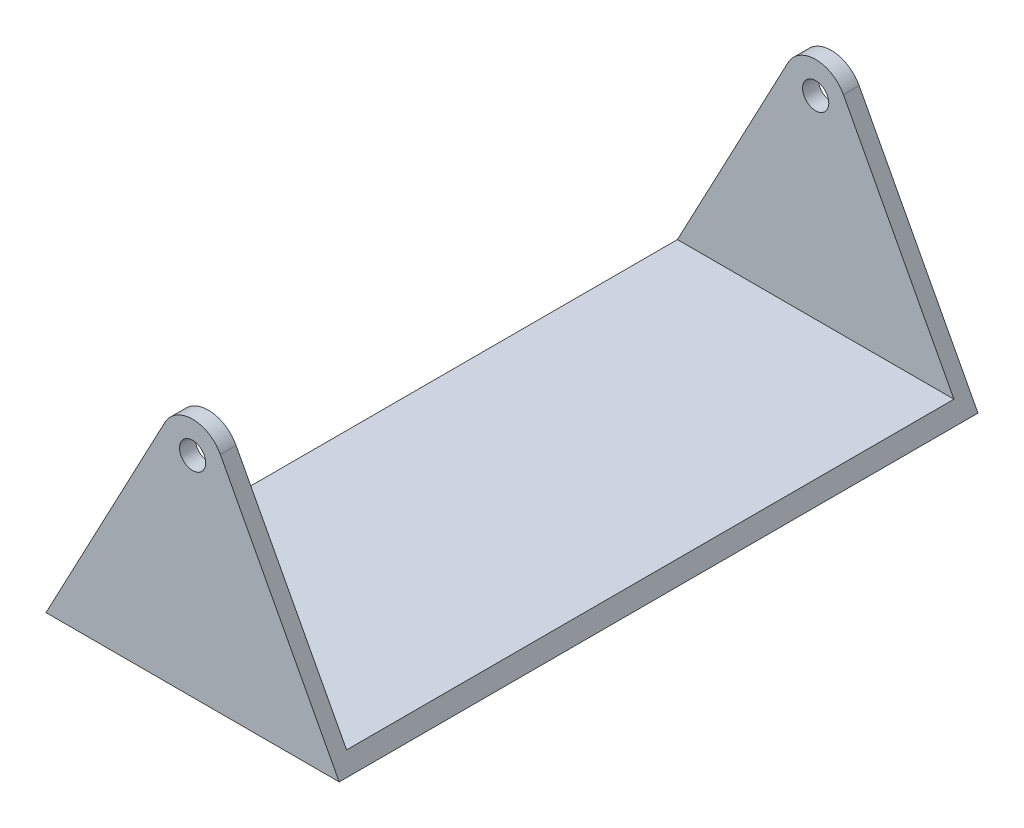
ISO-10303-21;
HEADER;
FILE_DESCRIPTION(('STEP AP214'),'2;1');
FILE_NAME('part.step','',(''),(''),'','','');
FILE_SCHEMA(('AUTOMOTIVE_DESIGN { 1 0 10303 214 1 1 1 1 }'));
ENDSEC;
DATA;
#1=APPLICATION_CONTEXT('core data for automotive mechanical design processes');
#2=APPLICATION_PROTOCOL_DEFINITION('international standard','automotive_design',2000,#1);
#3=PRODUCT_CONTEXT('',#1,'mechanical');
#4=PRODUCT('Part','Part','',(#3));
#5=PRODUCT_RELATED_PRODUCT_CATEGORY('part','',(#4));
#6=PRODUCT_DEFINITION_FORMATION('','',#4);
#7=PRODUCT_DEFINITION_CONTEXT('part definition',#1,'design');
#8=PRODUCT_DEFINITION('design','',#6,#7);
#9=PRODUCT_DEFINITION_SHAPE('','',#8);
#10=(LENGTH_UNIT() NAMED_UNIT(*) SI_UNIT(.MILLI.,.METRE.));
#11=(NAMED_UNIT(*) PLANE_ANGLE_UNIT() SI_UNIT($,.RADIAN.));
#12=(NAMED_UNIT(*) SI_UNIT($,.STERADIAN.) SOLID_ANGLE_UNIT());
#13=UNCERTAINTY_MEASURE_WITH_UNIT(LENGTH_MEASURE(1.E-05),#10,'distance_accuracy_value','');
#14=(GEOMETRIC_REPRESENTATION_CONTEXT(3) GLOBAL_UNCERTAINTY_ASSIGNED_CONTEXT((#13)) GLOBAL_UNIT_ASSIGNED_CONTEXT((#10,
#11,#12)) REPRESENTATION_CONTEXT('',''));
#15=CARTESIAN_POINT('',(0.,0.,0.));
#16=DIRECTION('',(0.,0.,1.));
#17=DIRECTION('',(1.,0.,0.));
#18=AXIS2_PLACEMENT_3D('',#15,#16,#17);
#19=CARTESIAN_POINT('',(0.,40.,61.));
#20=DIRECTION('',(0.,0.,-1.));
#21=DIRECTION('',(-1.,0.,0.));
#22=AXIS2_PLACEMENT_3D('',#19,#20,#21);
#23=CYLINDRICAL_SURFACE('',#22,6.);
#24=CARTESIAN_POINT('',(0.,40.,58.));
#25=DIRECTION('',(0.,0.,1.));
#26=DIRECTION('',(0.,-1.,0.));
#27=AXIS2_PLACEMENT_3D('',#24,#25,#26);
#28=CIRCLE('',#27,6.);
#29=CARTESIAN_POINT('',(5.30095628439693,42.8106693990778,58.));
#30=VERTEX_POINT('',#29);
#31=CARTESIAN_POINT('',(-5.30095628439693,42.8106693990779,58.));
#32=VERTEX_POINT('',#31);
#33=EDGE_CURVE('E137',#30,#32,#28,.T.);
#34=ORIENTED_EDGE('',*,*,#33,.T.);
#35=DIRECTION('',(0.,0.,-1.));
#36=VECTOR('',#35,1.);
#37=CARTESIAN_POINT('',(-5.30095628439693,42.8106693990779,61.));
#38=LINE('',#37,#36);
#39=CARTESIAN_POINT('',(-5.30095628439693,42.8106693990779,61.));
#40=VERTEX_POINT('',#39);
#41=EDGE_CURVE('E163',#40,#32,#38,.T.);
#42=ORIENTED_EDGE('',*,*,#41,.F.);
#43=CARTESIAN_POINT('',(0.,40.,61.));
#44=DIRECTION('',(0.,0.,1.));
#45=DIRECTION('',(1.,0.,0.));
#46=AXIS2_PLACEMENT_3D('',#43,#44,#45);
#47=CIRCLE('',#46,6.);
#48=CARTESIAN_POINT('',(5.30095628439693,42.8106693990778,61.));
#49=VERTEX_POINT('',#48);
#50=EDGE_CURVE('E149',#49,#40,#47,.T.);
#51=ORIENTED_EDGE('',*,*,#50,.F.);
#52=DIRECTION('',(0.,0.,-1.));
#53=VECTOR('',#52,1.);
#54=CARTESIAN_POINT('',(5.30095628439693,42.8106693990778,61.));
#55=LINE('',#54,#53);
#56=EDGE_CURVE('E166',#49,#30,#55,.T.);
#57=ORIENTED_EDGE('',*,*,#56,.T.);
#58=EDGE_LOOP('',(#34,#42,#51,#57));
#59=FACE_BOUND('',#58,.T.);
#60=ADVANCED_FACE('F33',(#59),#23,.T.);
#61=CARTESIAN_POINT('',(0.,40.,61.));
#62=DIRECTION('',(0.,0.,-1.));
#63=DIRECTION('',(-1.,0.,0.));
#64=AXIS2_PLACEMENT_3D('',#61,#62,#63);
#65=CYLINDRICAL_SURFACE('',#64,2.5);
#66=CARTESIAN_POINT('',(0.,40.,58.));
#67=DIRECTION('',(0.,0.,1.));
#68=DIRECTION('',(0.,-1.,0.));
#69=AXIS2_PLACEMENT_3D('',#66,#67,#68);
#70=CIRCLE('',#69,2.5);
#71=CARTESIAN_POINT('',(0.,37.5,58.));
#72=VERTEX_POINT('',#71);
#73=EDGE_CURVE('E127',#72,#72,#70,.T.);
#74=ORIENTED_EDGE('',*,*,#73,.F.);
#75=EDGE_LOOP('',(#74));
#76=FACE_BOUND('',#75,.T.);
#77=CARTESIAN_POINT('',(0.,40.,61.));
#78=DIRECTION('',(0.,0.,1.));
#79=DIRECTION('',(1.,0.,0.));
#80=AXIS2_PLACEMENT_3D('',#77,#78,#79);
#81=CIRCLE('',#80,2.5);
#82=CARTESIAN_POINT('',(2.5,40.,61.));
#83=VERTEX_POINT('',#82);
#84=EDGE_CURVE('E140',#83,#83,#81,.T.);
#85=ORIENTED_EDGE('',*,*,#84,.T.);
#86=EDGE_LOOP('',(#85));
#87=FACE_BOUND('',#86,.T.);
#88=ADVANCED_FACE('F204',(#76,#87),#65,.F.);
#89=CARTESIAN_POINT('',(0.,40.,61.));
#90=DIRECTION('',(0.,0.,1.));
#91=DIRECTION('',(1.,0.,0.));
#92=AXIS2_PLACEMENT_3D('',#89,#90,#91);
#93=PLANE('',#92);
#94=DIRECTION('',(1.,0.,0.));
#95=VECTOR('',#94,1.);
#96=CARTESIAN_POINT('',(28.,0.,61.));
#97=LINE('',#96,#95);
#98=CARTESIAN_POINT('',(-28.,0.,61.));
#99=VERTEX_POINT('',#98);
#100=CARTESIAN_POINT('',(28.,0.,61.));
#101=VERTEX_POINT('',#100);
#102=EDGE_CURVE('E146',#99,#101,#97,.T.);
#103=ORIENTED_EDGE('',*,*,#102,.T.);
#104=DIRECTION('',(-0.468444899846309,0.883492714066156,0.));
#105=VECTOR('',#104,1.);
#106=CARTESIAN_POINT('',(5.30095628439693,42.8106693990778,61.));
#107=LINE('',#106,#105);
#108=EDGE_CURVE('E85',#101,#49,#107,.T.);
#109=ORIENTED_EDGE('',*,*,#108,.T.);
#110=ORIENTED_EDGE('',*,*,#50,.T.);
#111=DIRECTION('',(-0.468444899846309,-0.883492714066155,0.));
#112=VECTOR('',#111,1.);
#113=CARTESIAN_POINT('',(-5.30095628439693,42.8106693990779,61.));
#114=LINE('',#113,#112);
#115=EDGE_CURVE('E57',#40,#99,#114,.T.);
#116=ORIENTED_EDGE('',*,*,#115,.T.);
#117=EDGE_LOOP('',(#103,#109,#110,#116));
#118=FACE_BOUND('',#117,.T.);
#119=ORIENTED_EDGE('',*,*,#84,.F.);
#120=EDGE_LOOP('',(#119));
#121=FACE_BOUND('',#120,.T.);
#122=ADVANCED_FACE('F209',(#118,#121),#93,.T.);
#123=CARTESIAN_POINT('',(0.,40.,-61.));
#124=DIRECTION('',(0.,0.,1.));
#125=DIRECTION('',(1.,0.,0.));
#126=AXIS2_PLACEMENT_3D('',#123,#124,#125);
#127=PLANE('',#126);
#128=DIRECTION('',(1.,0.,0.));
#129=VECTOR('',#128,1.);
#130=CARTESIAN_POINT('',(28.,0.,-61.));
#131=LINE('',#130,#129);
#132=CARTESIAN_POINT('',(-28.,0.,-61.));
#133=VERTEX_POINT('',#132);
#134=CARTESIAN_POINT('',(28.,0.,-61.));
#135=VERTEX_POINT('',#134);
#136=EDGE_CURVE('E143',#133,#135,#131,.T.);
#137=ORIENTED_EDGE('',*,*,#136,.F.);
#138=DIRECTION('',(-0.468444899846309,-0.883492714066155,0.));
#139=VECTOR('',#138,1.);
#140=CARTESIAN_POINT('',(-5.30095628439693,42.8106693990779,-61.));
#141=LINE('',#140,#139);
#142=CARTESIAN_POINT('',(-5.30095628439693,42.8106693990779,-61.));
#143=VERTEX_POINT('',#142);
#144=EDGE_CURVE('E77',#143,#133,#141,.T.);
#145=ORIENTED_EDGE('',*,*,#144,.F.);
#146=CARTESIAN_POINT('',(0.,40.,-61.));
#147=DIRECTION('',(0.,0.,1.));
#148=DIRECTION('',(1.,0.,0.));
#149=AXIS2_PLACEMENT_3D('',#146,#147,#148);
#150=CIRCLE('',#149,6.);
#151=CARTESIAN_POINT('',(5.30095628439693,42.8106693990778,-61.));
#152=VERTEX_POINT('',#151);
#153=EDGE_CURVE('E157',#152,#143,#150,.T.);
#154=ORIENTED_EDGE('',*,*,#153,.F.);
#155=DIRECTION('',(-0.468444899846309,0.883492714066156,0.));
#156=VECTOR('',#155,1.);
#157=CARTESIAN_POINT('',(5.30095628439693,42.8106693990778,-61.));
#158=LINE('',#157,#156);
#159=EDGE_CURVE('E155',#135,#152,#158,.T.);
#160=ORIENTED_EDGE('',*,*,#159,.F.);
#161=EDGE_LOOP('',(#137,#145,#154,#160));
#162=FACE_BOUND('',#161,.T.);
#163=CARTESIAN_POINT('',(0.,40.,-61.));
#164=DIRECTION('',(0.,0.,1.));
#165=DIRECTION('',(1.,0.,0.));
#166=AXIS2_PLACEMENT_3D('',#163,#164,#165);
#167=CIRCLE('',#166,2.5);
#168=CARTESIAN_POINT('',(2.5,40.,-61.));
#169=VERTEX_POINT('',#168);
#170=EDGE_CURVE('E112',#169,#169,#167,.T.);
#171=ORIENTED_EDGE('',*,*,#170,.T.);
#172=EDGE_LOOP('',(#171));
#173=FACE_BOUND('',#172,.T.);
#174=ADVANCED_FACE('F181',(#162,#173),#127,.F.);
#175=CARTESIAN_POINT('',(28.,0.,61.));
#176=DIRECTION('',(0.,1.,0.));
#177=DIRECTION('',(-1.,0.,0.));
#178=AXIS2_PLACEMENT_3D('',#175,#176,#177);
#179=PLANE('',#178);
#180=ORIENTED_EDGE('',*,*,#136,.T.);
#181=DIRECTION('',(0.,0.,-1.));
#182=VECTOR('',#181,1.);
#183=CARTESIAN_POINT('',(28.,0.,61.));
#184=LINE('',#183,#182);
#185=EDGE_CURVE('E41',#101,#135,#184,.T.);
#186=ORIENTED_EDGE('',*,*,#185,.F.);
#187=ORIENTED_EDGE('',*,*,#102,.F.);
#188=DIRECTION('',(0.,0.,-1.));
#189=VECTOR('',#188,1.);
#190=CARTESIAN_POINT('',(-28.,0.,61.));
#191=LINE('',#190,#189);
#192=EDGE_CURVE('E152',#99,#133,#191,.T.);
#193=ORIENTED_EDGE('',*,*,#192,.T.);
#194=EDGE_LOOP('',(#180,#186,#187,#193));
#195=FACE_BOUND('',#194,.T.);
#196=ADVANCED_FACE('F35',(#195),#179,.F.);
#197=CARTESIAN_POINT('',(5.30095628439693,42.8106693990778,61.));
#198=DIRECTION('',(-0.883492714066156,-0.468444899846309,0.));
#199=DIRECTION('',(0.468444899846309,-0.883492714066156,0.));
#200=AXIS2_PLACEMENT_3D('',#197,#198,#199);
#201=PLANE('',#200);
#202=DIRECTION('',(0.,0.,1.));
#203=VECTOR('',#202,1.);
#204=CARTESIAN_POINT('',(26.4093420611574,2.99999999999998,61.));
#205=LINE('',#204,#203);
#206=CARTESIAN_POINT('',(26.4093420611574,3.,-58.));
#207=VERTEX_POINT('',#206);
#208=CARTESIAN_POINT('',(26.4093420611574,2.99999999999999,58.));
#209=VERTEX_POINT('',#208);
#210=EDGE_CURVE('E106',#207,#209,#205,.T.);
#211=ORIENTED_EDGE('',*,*,#210,.T.);
#212=DIRECTION('',(-0.468444899846309,0.883492714066156,0.));
#213=VECTOR('',#212,1.);
#214=CARTESIAN_POINT('',(5.30095628439693,42.8106693990778,58.));
#215=LINE('',#214,#213);
#216=EDGE_CURVE('E113',#209,#30,#215,.T.);
#217=ORIENTED_EDGE('',*,*,#216,.T.);
#218=ORIENTED_EDGE('',*,*,#56,.F.);
#219=ORIENTED_EDGE('',*,*,#108,.F.);
#220=ORIENTED_EDGE('',*,*,#185,.T.);
#221=ORIENTED_EDGE('',*,*,#159,.T.);
#222=CARTESIAN_POINT('',(5.30095628439693,42.8106693990778,-58.));
#223=VERTEX_POINT('',#222);
#224=EDGE_CURVE('E126',#223,#152,#55,.T.);
#225=ORIENTED_EDGE('',*,*,#224,.F.);
#226=DIRECTION('',(0.468444899846309,-0.883492714066156,0.));
#227=VECTOR('',#226,1.);
#228=CARTESIAN_POINT('',(5.30095628439693,42.8106693990779,-58.));
#229=LINE('',#228,#227);
#230=EDGE_CURVE('E117',#223,#207,#229,.T.);
#231=ORIENTED_EDGE('',*,*,#230,.T.);
#232=EDGE_LOOP('',(#211,#217,#218,#219,#220,#221,#225,#231));
#233=FACE_BOUND('',#232,.T.);
#234=ADVANCED_FACE('F124',(#233),#201,.F.);
#235=CARTESIAN_POINT('',(-5.30095628439693,42.8106693990779,-58.));
#236=VERTEX_POINT('',#235);
#237=EDGE_CURVE('E162',#236,#143,#38,.T.);
#238=ORIENTED_EDGE('',*,*,#237,.F.);
#239=CARTESIAN_POINT('',(0.,40.,-58.));
#240=DIRECTION('',(0.,0.,-1.));
#241=DIRECTION('',(0.,1.,0.));
#242=AXIS2_PLACEMENT_3D('',#239,#240,#241);
#243=CIRCLE('',#242,6.);
#244=EDGE_CURVE('E128',#236,#223,#243,.T.);
#245=ORIENTED_EDGE('',*,*,#244,.T.);
#246=ORIENTED_EDGE('',*,*,#224,.T.);
#247=ORIENTED_EDGE('',*,*,#153,.T.);
#248=EDGE_LOOP('',(#238,#245,#246,#247));
#249=FACE_BOUND('',#248,.T.);
#250=ADVANCED_FACE('F177',(#249),#23,.T.);
#251=CARTESIAN_POINT('',(-5.30095628439693,42.8106693990779,61.));
#252=DIRECTION('',(0.883492714066155,-0.468444899846309,0.));
#253=DIRECTION('',(0.468444899846309,0.883492714066155,0.));
#254=AXIS2_PLACEMENT_3D('',#251,#252,#253);
#255=PLANE('',#254);
#256=ORIENTED_EDGE('',*,*,#41,.T.);
#257=DIRECTION('',(-0.468444899846309,-0.883492714066155,0.));
#258=VECTOR('',#257,1.);
#259=CARTESIAN_POINT('',(-5.30095628439693,42.8106693990779,58.));
#260=LINE('',#259,#258);
#261=CARTESIAN_POINT('',(-26.4093420611574,2.99999999999999,58.));
#262=VERTEX_POINT('',#261);
#263=EDGE_CURVE('E131',#32,#262,#260,.T.);
#264=ORIENTED_EDGE('',*,*,#263,.T.);
#265=DIRECTION('',(0.,0.,-1.));
#266=VECTOR('',#265,1.);
#267=CARTESIAN_POINT('',(-26.4093420611574,2.99999999999999,61.));
#268=LINE('',#267,#266);
#269=CARTESIAN_POINT('',(-26.4093420611574,3.,-58.));
#270=VERTEX_POINT('',#269);
#271=EDGE_CURVE('E11',#262,#270,#268,.T.);
#272=ORIENTED_EDGE('',*,*,#271,.T.);
#273=DIRECTION('',(0.468444899846309,0.883492714066155,0.));
#274=VECTOR('',#273,1.);
#275=CARTESIAN_POINT('',(-5.30095628439692,42.8106693990779,-58.));
#276=LINE('',#275,#274);
#277=EDGE_CURVE('E120',#270,#236,#276,.T.);
#278=ORIENTED_EDGE('',*,*,#277,.T.);
#279=ORIENTED_EDGE('',*,*,#237,.T.);
#280=ORIENTED_EDGE('',*,*,#144,.T.);
#281=ORIENTED_EDGE('',*,*,#192,.F.);
#282=ORIENTED_EDGE('',*,*,#115,.F.);
#283=EDGE_LOOP('',(#256,#264,#272,#278,#279,#280,#281,#282));
#284=FACE_BOUND('',#283,.T.);
#285=ADVANCED_FACE('F175',(#284),#255,.F.);
#286=CARTESIAN_POINT('',(0.,40.,-58.));
#287=DIRECTION('',(0.,0.,-1.));
#288=DIRECTION('',(0.,1.,0.));
#289=AXIS2_PLACEMENT_3D('',#286,#287,#288);
#290=CIRCLE('',#289,2.5);
#291=CARTESIAN_POINT('',(0.,42.5,-58.));
#292=VERTEX_POINT('',#291);
#293=EDGE_CURVE('E121',#292,#292,#290,.T.);
#294=ORIENTED_EDGE('',*,*,#293,.F.);
#295=EDGE_LOOP('',(#294));
#296=FACE_BOUND('',#295,.T.);
#297=ORIENTED_EDGE('',*,*,#170,.F.);
#298=EDGE_LOOP('',(#297));
#299=FACE_BOUND('',#298,.T.);
#300=ADVANCED_FACE('F200',(#296,#299),#65,.F.);
#301=CARTESIAN_POINT('',(-28.,3.,-58.));
#302=DIRECTION('',(0.,-1.,0.));
#303=DIRECTION('',(0.,0.,-1.));
#304=AXIS2_PLACEMENT_3D('',#301,#302,#303);
#305=PLANE('',#304);
#306=DIRECTION('',(1.,0.,0.));
#307=VECTOR('',#306,1.);
#308=CARTESIAN_POINT('',(-28.,3.,-58.));
#309=LINE('',#308,#307);
#310=EDGE_CURVE('E48',#270,#207,#309,.T.);
#311=ORIENTED_EDGE('',*,*,#310,.F.);
#312=ORIENTED_EDGE('',*,*,#271,.F.);
#313=DIRECTION('',(1.,0.,0.));
#314=VECTOR('',#313,1.);
#315=CARTESIAN_POINT('',(-28.,2.99999999999999,58.));
#316=LINE('',#315,#314);
#317=EDGE_CURVE('E109',#262,#209,#316,.T.);
#318=ORIENTED_EDGE('',*,*,#317,.T.);
#319=ORIENTED_EDGE('',*,*,#210,.F.);
#320=EDGE_LOOP('',(#311,#312,#318,#319));
#321=FACE_BOUND('',#320,.T.);
#322=ADVANCED_FACE('F107',(#321),#305,.F.);
#323=CARTESIAN_POINT('',(-28.,46.,58.));
#324=DIRECTION('',(0.,0.,1.));
#325=DIRECTION('',(0.,-1.,0.));
#326=AXIS2_PLACEMENT_3D('',#323,#324,#325);
#327=PLANE('',#326);
#328=ORIENTED_EDGE('',*,*,#73,.T.);
#329=EDGE_LOOP('',(#328));
#330=FACE_BOUND('',#329,.T.);
#331=ORIENTED_EDGE('',*,*,#317,.F.);
#332=ORIENTED_EDGE('',*,*,#263,.F.);
#333=ORIENTED_EDGE('',*,*,#33,.F.);
#334=ORIENTED_EDGE('',*,*,#216,.F.);
#335=EDGE_LOOP('',(#331,#332,#333,#334));
#336=FACE_BOUND('',#335,.T.);
#337=ADVANCED_FACE('F191',(#330,#336),#327,.F.);
#338=CARTESIAN_POINT('',(-28.,46.,-58.));
#339=DIRECTION('',(0.,0.,-1.));
#340=DIRECTION('',(0.,1.,0.));
#341=AXIS2_PLACEMENT_3D('',#338,#339,#340);
#342=PLANE('',#341);
#343=ORIENTED_EDGE('',*,*,#293,.T.);
#344=EDGE_LOOP('',(#343));
#345=FACE_BOUND('',#344,.T.);
#346=ORIENTED_EDGE('',*,*,#244,.F.);
#347=ORIENTED_EDGE('',*,*,#277,.F.);
#348=ORIENTED_EDGE('',*,*,#310,.T.);
#349=ORIENTED_EDGE('',*,*,#230,.F.);
#350=EDGE_LOOP('',(#346,#347,#348,#349));
#351=FACE_BOUND('',#350,.T.);
#352=ADVANCED_FACE('F116',(#345,#351),#342,.F.);
#353=CLOSED_SHELL('',(#60,#88,#122,#174,#196,#234,#250,#285,#300,#322,#337,#352));
#354=MANIFOLD_SOLID_BREP('B2',#353);
#355=ADVANCED_BREP_SHAPE_REPRESENTATION('',(#18,#354),#14);
#356=SHAPE_DEFINITION_REPRESENTATION(#9,#355);
ENDSEC;
END-ISO-10303-21;
